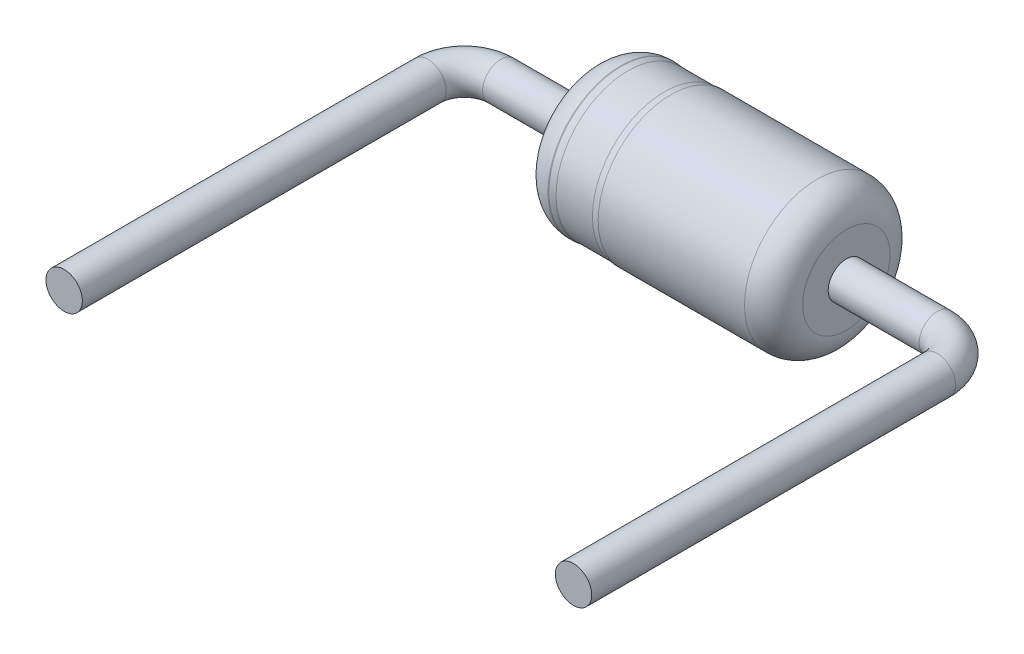
ISO-10303-21;
HEADER;
FILE_DESCRIPTION(('STEP AP214'),'2;1');
FILE_NAME('part.step','',(''),(''),'','','');
FILE_SCHEMA(('AUTOMOTIVE_DESIGN { 1 0 10303 214 1 1 1 1 }'));
ENDSEC;
DATA;
#1=APPLICATION_CONTEXT('core data for automotive mechanical design processes');
#2=APPLICATION_PROTOCOL_DEFINITION('international standard','automotive_design',2000,#1);
#3=PRODUCT_CONTEXT('',#1,'mechanical');
#4=PRODUCT('Part','Part','',(#3));
#5=PRODUCT_RELATED_PRODUCT_CATEGORY('part','',(#4));
#6=PRODUCT_DEFINITION_FORMATION('','',#4);
#7=PRODUCT_DEFINITION_CONTEXT('part definition',#1,'design');
#8=PRODUCT_DEFINITION('design','',#6,#7);
#9=PRODUCT_DEFINITION_SHAPE('','',#8);
#10=(LENGTH_UNIT() NAMED_UNIT(*) SI_UNIT(.MILLI.,.METRE.));
#11=(NAMED_UNIT(*) PLANE_ANGLE_UNIT() SI_UNIT($,.RADIAN.));
#12=(NAMED_UNIT(*) SI_UNIT($,.STERADIAN.) SOLID_ANGLE_UNIT());
#13=UNCERTAINTY_MEASURE_WITH_UNIT(LENGTH_MEASURE(1.E-05),#10,'distance_accuracy_value','');
#14=(GEOMETRIC_REPRESENTATION_CONTEXT(3) GLOBAL_UNCERTAINTY_ASSIGNED_CONTEXT((#13)) GLOBAL_UNIT_ASSIGNED_CONTEXT((#10,
#11,#12)) REPRESENTATION_CONTEXT('',''));
#15=CARTESIAN_POINT('',(0.,0.,0.));
#16=DIRECTION('',(0.,0.,1.));
#17=DIRECTION('',(1.,0.,0.));
#18=AXIS2_PLACEMENT_3D('',#15,#16,#17);
#19=CARTESIAN_POINT('',(1.75,0.,0.));
#20=DIRECTION('',(1.,0.,0.));
#21=DIRECTION('',(0.,0.,-1.));
#22=AXIS2_PLACEMENT_3D('',#19,#20,#21);
#23=PLANE('',#22);
#24=CARTESIAN_POINT('',(1.75,0.,0.));
#25=DIRECTION('',(1.,0.,0.));
#26=DIRECTION('',(0.,0.,-1.));
#27=AXIS2_PLACEMENT_3D('',#24,#25,#26);
#28=CIRCLE('',#27,0.6);
#29=CARTESIAN_POINT('',(1.75,0.,-0.6));
#30=VERTEX_POINT('',#29);
#31=EDGE_CURVE('E45',#30,#30,#28,.T.);
#32=ORIENTED_EDGE('',*,*,#31,.T.);
#33=EDGE_LOOP('',(#32));
#34=FACE_BOUND('',#33,.T.);
#35=CARTESIAN_POINT('',(1.75,0.,0.));
#36=DIRECTION('',(1.,0.,0.));
#37=DIRECTION('',(0.,0.,-1.));
#38=AXIS2_PLACEMENT_3D('',#35,#36,#37);
#39=CIRCLE('',#38,0.25);
#40=CARTESIAN_POINT('',(1.75,0.,-0.25));
#41=VERTEX_POINT('',#40);
#42=EDGE_CURVE('E57',#41,#41,#39,.F.);
#43=ORIENTED_EDGE('',*,*,#42,.T.);
#44=EDGE_LOOP('',(#43));
#45=FACE_BOUND('',#44,.T.);
#46=ADVANCED_FACE('F30',(#34,#45),#23,.T.);
#47=CARTESIAN_POINT('',(-1.75,0.,0.));
#48=DIRECTION('',(-1.,0.,0.));
#49=DIRECTION('',(0.,0.,1.));
#50=AXIS2_PLACEMENT_3D('',#47,#48,#49);
#51=PLANE('',#50);
#52=CARTESIAN_POINT('',(-1.75,0.,0.));
#53=DIRECTION('',(-1.,0.,0.));
#54=DIRECTION('',(0.,0.,1.));
#55=AXIS2_PLACEMENT_3D('',#52,#53,#54);
#56=CIRCLE('',#55,0.6);
#57=CARTESIAN_POINT('',(-1.75,0.,0.6));
#58=VERTEX_POINT('',#57);
#59=EDGE_CURVE('E41',#58,#58,#56,.T.);
#60=ORIENTED_EDGE('',*,*,#59,.T.);
#61=EDGE_LOOP('',(#60));
#62=FACE_BOUND('',#61,.T.);
#63=CARTESIAN_POINT('',(-1.75,0.,0.));
#64=DIRECTION('',(-1.,0.,0.));
#65=DIRECTION('',(0.,0.,1.));
#66=AXIS2_PLACEMENT_3D('',#63,#64,#65);
#67=CIRCLE('',#66,0.25);
#68=CARTESIAN_POINT('',(-1.75,0.,0.25));
#69=VERTEX_POINT('',#68);
#70=EDGE_CURVE('E62',#69,#69,#67,.F.);
#71=ORIENTED_EDGE('',*,*,#70,.T.);
#72=EDGE_LOOP('',(#71));
#73=FACE_BOUND('',#72,.T.);
#74=ADVANCED_FACE('F106',(#62,#73),#51,.T.);
#75=CARTESIAN_POINT('',(-1.75,0.,0.));
#76=DIRECTION('',(-1.,0.,0.));
#77=DIRECTION('',(0.,0.,1.));
#78=AXIS2_PLACEMENT_3D('',#75,#76,#77);
#79=CYLINDRICAL_SURFACE('',#78,1.);
#80=CARTESIAN_POINT('',(-1.35,0.,0.));
#81=DIRECTION('',(-1.,0.,0.));
#82=DIRECTION('',(0.,0.,1.));
#83=AXIS2_PLACEMENT_3D('',#80,#81,#82);
#84=CIRCLE('',#83,1.);
#85=CARTESIAN_POINT('',(-1.35,0.,1.));
#86=VERTEX_POINT('',#85);
#87=EDGE_CURVE('E10',#86,#86,#84,.F.);
#88=ORIENTED_EDGE('',*,*,#87,.T.);
#89=EDGE_LOOP('',(#88));
#90=FACE_BOUND('',#89,.T.);
#91=CARTESIAN_POINT('',(-1.33888194417316,0.,0.));
#92=DIRECTION('',(1.,0.,0.));
#93=DIRECTION('',(0.,0.,-1.));
#94=AXIS2_PLACEMENT_3D('',#91,#92,#93);
#95=CIRCLE('',#94,1.);
#96=CARTESIAN_POINT('',(-1.33888194417316,0.,-1.));
#97=VERTEX_POINT('',#96);
#98=EDGE_CURVE('E37',#97,#97,#95,.F.);
#99=ORIENTED_EDGE('',*,*,#98,.T.);
#100=EDGE_LOOP('',(#99));
#101=FACE_BOUND('',#100,.T.);
#102=ADVANCED_FACE('F112',(#90,#101),#79,.T.);
#103=CARTESIAN_POINT('',(-1.75,0.,0.));
#104=DIRECTION('',(-1.,0.,0.));
#105=DIRECTION('',(0.,0.,1.));
#106=AXIS2_PLACEMENT_3D('',#103,#104,#105);
#107=CYLINDRICAL_SURFACE('',#106,0.99);
#108=CARTESIAN_POINT('',(-0.75,0.,0.));
#109=DIRECTION('',(-1.,0.,0.));
#110=DIRECTION('',(0.,0.,1.));
#111=AXIS2_PLACEMENT_3D('',#108,#109,#110);
#112=CIRCLE('',#111,0.99);
#113=CARTESIAN_POINT('',(-0.75,0.,0.99));
#114=VERTEX_POINT('',#113);
#115=EDGE_CURVE('E65',#114,#114,#112,.T.);
#116=ORIENTED_EDGE('',*,*,#115,.T.);
#117=EDGE_LOOP('',(#116));
#118=FACE_BOUND('',#117,.T.);
#119=CARTESIAN_POINT('',(-1.25,0.,0.));
#120=DIRECTION('',(-1.,0.,0.));
#121=DIRECTION('',(0.,0.,1.));
#122=AXIS2_PLACEMENT_3D('',#119,#120,#121);
#123=CIRCLE('',#122,0.99);
#124=CARTESIAN_POINT('',(-1.25,0.,0.99));
#125=VERTEX_POINT('',#124);
#126=EDGE_CURVE('E56',#125,#125,#123,.T.);
#127=ORIENTED_EDGE('',*,*,#126,.F.);
#128=EDGE_LOOP('',(#127));
#129=FACE_BOUND('',#128,.T.);
#130=ADVANCED_FACE('F123',(#118,#129),#107,.T.);
#131=CARTESIAN_POINT('',(-1.75,0.,0.));
#132=DIRECTION('',(-1.,0.,0.));
#133=DIRECTION('',(0.,0.,1.));
#134=AXIS2_PLACEMENT_3D('',#131,#132,#133);
#135=CYLINDRICAL_SURFACE('',#134,1.);
#136=CARTESIAN_POINT('',(-0.661118055826843,0.,0.));
#137=DIRECTION('',(-1.,0.,0.));
#138=DIRECTION('',(0.,0.,1.));
#139=AXIS2_PLACEMENT_3D('',#136,#137,#138);
#140=CIRCLE('',#139,1.);
#141=CARTESIAN_POINT('',(-0.661118055826843,0.,1.));
#142=VERTEX_POINT('',#141);
#143=EDGE_CURVE('E50',#142,#142,#140,.F.);
#144=ORIENTED_EDGE('',*,*,#143,.T.);
#145=EDGE_LOOP('',(#144));
#146=FACE_BOUND('',#145,.T.);
#147=CARTESIAN_POINT('',(1.35,0.,0.));
#148=DIRECTION('',(1.,0.,0.));
#149=DIRECTION('',(0.,0.,-1.));
#150=AXIS2_PLACEMENT_3D('',#147,#148,#149);
#151=CIRCLE('',#150,1.);
#152=CARTESIAN_POINT('',(1.35,0.,-1.));
#153=VERTEX_POINT('',#152);
#154=EDGE_CURVE('E53',#153,#153,#151,.F.);
#155=ORIENTED_EDGE('',*,*,#154,.T.);
#156=EDGE_LOOP('',(#155));
#157=FACE_BOUND('',#156,.T.);
#158=ADVANCED_FACE('F120',(#146,#157),#135,.T.);
#159=CARTESIAN_POINT('',(-3.5,0.,0.5));
#160=DIRECTION('',(0.,0.,1.));
#161=DIRECTION('',(1.,0.,0.));
#162=AXIS2_PLACEMENT_3D('',#159,#160,#161);
#163=CYLINDRICAL_SURFACE('',#162,0.25);
#164=CARTESIAN_POINT('',(-3.5,0.,0.5));
#165=DIRECTION('',(0.,0.,1.));
#166=DIRECTION('',(1.,0.,0.));
#167=AXIS2_PLACEMENT_3D('',#164,#165,#166);
#168=CIRCLE('',#167,0.25);
#169=CARTESIAN_POINT('',(-3.75,0.,0.5));
#170=VERTEX_POINT('',#169);
#171=EDGE_CURVE('E73',#170,#170,#168,.T.);
#172=ORIENTED_EDGE('',*,*,#171,.T.);
#173=EDGE_LOOP('',(#172));
#174=FACE_BOUND('',#173,.T.);
#175=CARTESIAN_POINT('',(-3.5,0.,5.5));
#176=DIRECTION('',(0.,0.,1.));
#177=DIRECTION('',(1.,0.,0.));
#178=AXIS2_PLACEMENT_3D('',#175,#176,#177);
#179=CIRCLE('',#178,0.25);
#180=CARTESIAN_POINT('',(-3.25,0.,5.5));
#181=VERTEX_POINT('',#180);
#182=EDGE_CURVE('E66',#181,#181,#179,.T.);
#183=ORIENTED_EDGE('',*,*,#182,.F.);
#184=EDGE_LOOP('',(#183));
#185=FACE_BOUND('',#184,.T.);
#186=ADVANCED_FACE('F118',(#174,#185),#163,.T.);
#187=CARTESIAN_POINT('',(-3.,0.,0.5));
#188=DIRECTION('',(0.,1.,0.));
#189=DIRECTION('',(0.,0.,1.));
#190=AXIS2_PLACEMENT_3D('',#187,#188,#189);
#191=TOROIDAL_SURFACE('',#190,0.5,0.25);
#192=CARTESIAN_POINT('',(-3.,0.,0.));
#193=DIRECTION('',(-1.,0.,0.));
#194=DIRECTION('',(0.,0.,1.));
#195=AXIS2_PLACEMENT_3D('',#192,#193,#194);
#196=CIRCLE('',#195,0.25);
#197=CARTESIAN_POINT('',(-3.,0.,-0.25));
#198=VERTEX_POINT('',#197);
#199=EDGE_CURVE('E60',#198,#198,#196,.T.);
#200=CARTESIAN_POINT('',(-3.,0.,0.5));
#201=DIRECTION('',(0.,1.,0.));
#202=DIRECTION('',(0.,0.,1.));
#203=AXIS2_PLACEMENT_3D('',#200,#201,#202);
#204=CIRCLE('',#203,0.75);
#205=EDGE_CURVE('',#198,#170,#204,.T.);
#206=ORIENTED_EDGE('',*,*,#199,.T.);
#207=ORIENTED_EDGE('',*,*,#171,.F.);
#208=ORIENTED_EDGE('',*,*,#205,.T.);
#209=ORIENTED_EDGE('',*,*,#205,.F.);
#210=EDGE_LOOP('',(#206,#208,#207,#209));
#211=FACE_BOUND('',#210,.T.);
#212=ADVANCED_FACE('F152',(#211),#191,.T.);
#213=CARTESIAN_POINT('',(-3.,0.,0.));
#214=DIRECTION('',(1.,0.,0.));
#215=DIRECTION('',(0.,0.,-1.));
#216=AXIS2_PLACEMENT_3D('',#213,#214,#215);
#217=CYLINDRICAL_SURFACE('',#216,0.25);
#218=ORIENTED_EDGE('',*,*,#70,.F.);
#219=EDGE_LOOP('',(#218));
#220=FACE_BOUND('',#219,.T.);
#221=ORIENTED_EDGE('',*,*,#199,.F.);
#222=EDGE_LOOP('',(#221));
#223=FACE_BOUND('',#222,.T.);
#224=ADVANCED_FACE('F148',(#220,#223),#217,.T.);
#225=CARTESIAN_POINT('',(-3.5,0.,5.5));
#226=DIRECTION('',(0.,0.,1.));
#227=DIRECTION('',(1.,0.,0.));
#228=AXIS2_PLACEMENT_3D('',#225,#226,#227);
#229=PLANE('',#228);
#230=ORIENTED_EDGE('',*,*,#182,.T.);
#231=EDGE_LOOP('',(#230));
#232=FACE_BOUND('',#231,.T.);
#233=ADVANCED_FACE('F151',(#232),#229,.T.);
#234=CARTESIAN_POINT('',(3.5,0.,0.5));
#235=DIRECTION('',(0.,0.,1.));
#236=DIRECTION('',(1.,0.,0.));
#237=AXIS2_PLACEMENT_3D('',#234,#235,#236);
#238=CYLINDRICAL_SURFACE('',#237,0.25);
#239=CARTESIAN_POINT('',(3.5,0.,0.5));
#240=DIRECTION('',(0.,0.,1.));
#241=DIRECTION('',(1.,0.,0.));
#242=AXIS2_PLACEMENT_3D('',#239,#240,#241);
#243=CIRCLE('',#242,0.25);
#244=CARTESIAN_POINT('',(3.75,0.,0.5));
#245=VERTEX_POINT('',#244);
#246=EDGE_CURVE('E80',#245,#245,#243,.T.);
#247=ORIENTED_EDGE('',*,*,#246,.T.);
#248=EDGE_LOOP('',(#247));
#249=FACE_BOUND('',#248,.T.);
#250=CARTESIAN_POINT('',(3.5,0.,5.5));
#251=DIRECTION('',(0.,0.,1.));
#252=DIRECTION('',(1.,0.,0.));
#253=AXIS2_PLACEMENT_3D('',#250,#251,#252);
#254=CIRCLE('',#253,0.25);
#255=CARTESIAN_POINT('',(3.75,0.,5.5));
#256=VERTEX_POINT('',#255);
#257=EDGE_CURVE('E61',#256,#256,#254,.T.);
#258=ORIENTED_EDGE('',*,*,#257,.F.);
#259=EDGE_LOOP('',(#258));
#260=FACE_BOUND('',#259,.T.);
#261=ADVANCED_FACE('F102',(#249,#260),#238,.T.);
#262=CARTESIAN_POINT('',(3.,0.,0.5));
#263=DIRECTION('',(0.,-1.,0.));
#264=DIRECTION('',(0.,0.,-1.));
#265=AXIS2_PLACEMENT_3D('',#262,#263,#264);
#266=TOROIDAL_SURFACE('',#265,0.5,0.25);
#267=CARTESIAN_POINT('',(3.,0.,0.));
#268=DIRECTION('',(1.,0.,0.));
#269=DIRECTION('',(0.,0.,-1.));
#270=AXIS2_PLACEMENT_3D('',#267,#268,#269);
#271=CIRCLE('',#270,0.25);
#272=CARTESIAN_POINT('',(3.,0.,-0.25));
#273=VERTEX_POINT('',#272);
#274=EDGE_CURVE('E83',#273,#273,#271,.T.);
#275=CARTESIAN_POINT('',(3.,0.,0.5));
#276=DIRECTION('',(0.,-1.,0.));
#277=DIRECTION('',(0.,0.,-1.));
#278=AXIS2_PLACEMENT_3D('',#275,#276,#277);
#279=CIRCLE('',#278,0.75);
#280=EDGE_CURVE('',#273,#245,#279,.T.);
#281=ORIENTED_EDGE('',*,*,#274,.T.);
#282=ORIENTED_EDGE('',*,*,#246,.F.);
#283=ORIENTED_EDGE('',*,*,#280,.T.);
#284=ORIENTED_EDGE('',*,*,#280,.F.);
#285=EDGE_LOOP('',(#281,#283,#282,#284));
#286=FACE_BOUND('',#285,.T.);
#287=ADVANCED_FACE('F87',(#286),#266,.T.);
#288=CARTESIAN_POINT('',(3.,0.,0.));
#289=DIRECTION('',(-1.,0.,0.));
#290=DIRECTION('',(0.,0.,1.));
#291=AXIS2_PLACEMENT_3D('',#288,#289,#290);
#292=CYLINDRICAL_SURFACE('',#291,0.25);
#293=ORIENTED_EDGE('',*,*,#42,.F.);
#294=EDGE_LOOP('',(#293));
#295=FACE_BOUND('',#294,.T.);
#296=ORIENTED_EDGE('',*,*,#274,.F.);
#297=EDGE_LOOP('',(#296));
#298=FACE_BOUND('',#297,.T.);
#299=ADVANCED_FACE('F90',(#295,#298),#292,.T.);
#300=CARTESIAN_POINT('',(3.5,0.,5.5));
#301=DIRECTION('',(0.,0.,1.));
#302=DIRECTION('',(1.,0.,0.));
#303=AXIS2_PLACEMENT_3D('',#300,#301,#302);
#304=PLANE('',#303);
#305=ORIENTED_EDGE('',*,*,#257,.T.);
#306=EDGE_LOOP('',(#305));
#307=FACE_BOUND('',#306,.T.);
#308=ADVANCED_FACE('F92',(#307),#304,.T.);
#309=CARTESIAN_POINT('',(-0.661118055826843,0.,0.));
#310=DIRECTION('',(-1.,0.,0.));
#311=DIRECTION('',(0.,0.,1.));
#312=AXIS2_PLACEMENT_3D('',#309,#310,#311);
#313=TOROIDAL_SURFACE('',#312,0.6,0.4);
#314=ORIENTED_EDGE('',*,*,#143,.F.);
#315=EDGE_LOOP('',(#314));
#316=FACE_BOUND('',#315,.T.);
#317=ORIENTED_EDGE('',*,*,#115,.F.);
#318=EDGE_LOOP('',(#317));
#319=FACE_BOUND('',#318,.T.);
#320=ADVANCED_FACE('F99',(#316,#319),#313,.T.);
#321=CARTESIAN_POINT('',(1.35,0.,0.));
#322=DIRECTION('',(1.,0.,0.));
#323=DIRECTION('',(0.,0.,-1.));
#324=AXIS2_PLACEMENT_3D('',#321,#322,#323);
#325=TOROIDAL_SURFACE('',#324,0.6,0.4);
#326=ORIENTED_EDGE('',*,*,#31,.F.);
#327=EDGE_LOOP('',(#326));
#328=FACE_BOUND('',#327,.T.);
#329=ORIENTED_EDGE('',*,*,#154,.F.);
#330=EDGE_LOOP('',(#329));
#331=FACE_BOUND('',#330,.T.);
#332=ADVANCED_FACE('F132',(#328,#331),#325,.T.);
#333=CARTESIAN_POINT('',(-1.35,0.,0.));
#334=DIRECTION('',(-1.,0.,0.));
#335=DIRECTION('',(0.,0.,1.));
#336=AXIS2_PLACEMENT_3D('',#333,#334,#335);
#337=TOROIDAL_SURFACE('',#336,0.6,0.4);
#338=ORIENTED_EDGE('',*,*,#87,.F.);
#339=EDGE_LOOP('',(#338));
#340=FACE_BOUND('',#339,.T.);
#341=ORIENTED_EDGE('',*,*,#59,.F.);
#342=EDGE_LOOP('',(#341));
#343=FACE_BOUND('',#342,.T.);
#344=ADVANCED_FACE('F135',(#340,#343),#337,.T.);
#345=CARTESIAN_POINT('',(-1.33888194417316,0.,0.));
#346=DIRECTION('',(1.,0.,0.));
#347=DIRECTION('',(0.,0.,-1.));
#348=AXIS2_PLACEMENT_3D('',#345,#346,#347);
#349=TOROIDAL_SURFACE('',#348,0.6,0.4);
#350=ORIENTED_EDGE('',*,*,#126,.T.);
#351=EDGE_LOOP('',(#350));
#352=FACE_BOUND('',#351,.T.);
#353=ORIENTED_EDGE('',*,*,#98,.F.);
#354=EDGE_LOOP('',(#353));
#355=FACE_BOUND('',#354,.T.);
#356=ADVANCED_FACE('F32',(#352,#355),#349,.T.);
#357=CLOSED_SHELL('',(#46,#74,#102,#130,#158,#186,#212,#224,#233,#261,#287,#299,#308,#320,#332,
#344,#356));
#358=MANIFOLD_SOLID_BREP('B2',#357);
#359=ADVANCED_BREP_SHAPE_REPRESENTATION('',(#18,#358),#14);
#360=SHAPE_DEFINITION_REPRESENTATION(#9,#359);
ENDSEC;
END-ISO-10303-21;
